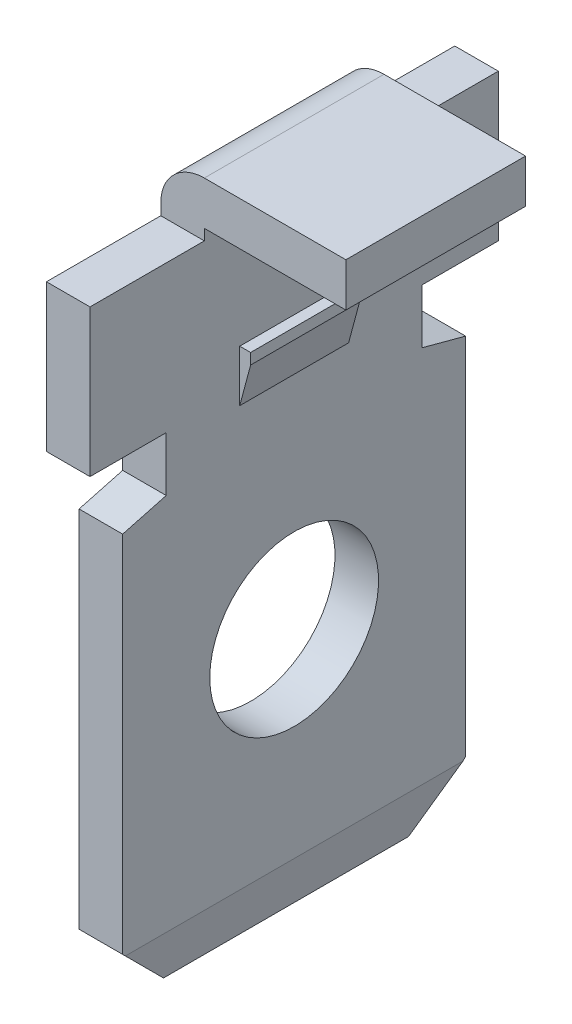
ISO-10303-21;
HEADER;
FILE_DESCRIPTION(('STEP AP214'),'2;1');
FILE_NAME('part.step','',(''),(''),'','','');
FILE_SCHEMA(('AUTOMOTIVE_DESIGN { 1 0 10303 214 1 1 1 1 }'));
ENDSEC;
DATA;
#1=APPLICATION_CONTEXT('core data for automotive mechanical design processes');
#2=APPLICATION_PROTOCOL_DEFINITION('international standard','automotive_design',2000,#1);
#3=PRODUCT_CONTEXT('',#1,'mechanical');
#4=PRODUCT('Part','Part','',(#3));
#5=PRODUCT_RELATED_PRODUCT_CATEGORY('part','',(#4));
#6=PRODUCT_DEFINITION_FORMATION('','',#4);
#7=PRODUCT_DEFINITION_CONTEXT('part definition',#1,'design');
#8=PRODUCT_DEFINITION('design','',#6,#7);
#9=PRODUCT_DEFINITION_SHAPE('','',#8);
#10=(LENGTH_UNIT() NAMED_UNIT(*) SI_UNIT(.MILLI.,.METRE.));
#11=(NAMED_UNIT(*) PLANE_ANGLE_UNIT() SI_UNIT($,.RADIAN.));
#12=(NAMED_UNIT(*) SI_UNIT($,.STERADIAN.) SOLID_ANGLE_UNIT());
#13=UNCERTAINTY_MEASURE_WITH_UNIT(LENGTH_MEASURE(1.E-05),#10,'distance_accuracy_value','');
#14=(GEOMETRIC_REPRESENTATION_CONTEXT(3) GLOBAL_UNCERTAINTY_ASSIGNED_CONTEXT((#13)) GLOBAL_UNIT_ASSIGNED_CONTEXT((#10,
#11,#12)) REPRESENTATION_CONTEXT('',''));
#15=CARTESIAN_POINT('',(0.,0.,0.));
#16=DIRECTION('',(0.,0.,1.));
#17=DIRECTION('',(1.,0.,0.));
#18=AXIS2_PLACEMENT_3D('',#15,#16,#17);
#19=CARTESIAN_POINT('',(0.2,-2.4,-1.));
#20=DIRECTION('',(1.,0.,0.));
#21=DIRECTION('',(0.,0.,-1.));
#22=AXIS2_PLACEMENT_3D('',#19,#20,#21);
#23=PLANE('',#22);
#24=DIRECTION('',(0.,0.,1.));
#25=VECTOR('',#24,1.);
#26=CARTESIAN_POINT('',(0.200000000000035,-2.40000000000001,-1.));
#27=LINE('',#26,#25);
#28=CARTESIAN_POINT('',(0.200000000000009,-2.4,-1.));
#29=VERTEX_POINT('',#28);
#30=CARTESIAN_POINT('',(0.200000000000018,-2.4,1.));
#31=VERTEX_POINT('',#30);
#32=EDGE_CURVE('E288',#29,#31,#27,.T.);
#33=ORIENTED_EDGE('',*,*,#32,.F.);
#34=DIRECTION('',(0.,1.,0.));
#35=VECTOR('',#34,1.);
#36=CARTESIAN_POINT('',(0.2,-2.4,-1.));
#37=LINE('',#36,#35);
#38=CARTESIAN_POINT('',(0.2,-2.2,-1.));
#39=VERTEX_POINT('',#38);
#40=EDGE_CURVE('E264',#29,#39,#37,.T.);
#41=ORIENTED_EDGE('',*,*,#40,.T.);
#42=DIRECTION('',(0.,0.,1.));
#43=VECTOR('',#42,1.);
#44=CARTESIAN_POINT('',(0.2,-2.2,-1.));
#45=LINE('',#44,#43);
#46=CARTESIAN_POINT('',(0.2,-2.2,1.));
#47=VERTEX_POINT('',#46);
#48=EDGE_CURVE('E412',#47,#39,#45,.F.);
#49=ORIENTED_EDGE('',*,*,#48,.F.);
#50=DIRECTION('',(0.,1.,0.));
#51=VECTOR('',#50,1.);
#52=CARTESIAN_POINT('',(0.2,0.,1.));
#53=LINE('',#52,#51);
#54=EDGE_CURVE('E418',#31,#47,#53,.T.);
#55=ORIENTED_EDGE('',*,*,#54,.F.);
#56=EDGE_LOOP('',(#33,#41,#49,#55));
#57=FACE_BOUND('',#56,.T.);
#58=ADVANCED_FACE('F16',(#57),#23,.T.);
#59=CARTESIAN_POINT('',(-0.8,0.8,1.65));
#60=DIRECTION('',(0.,0.,-1.));
#61=DIRECTION('',(-1.,0.,0.));
#62=AXIS2_PLACEMENT_3D('',#59,#60,#61);
#63=PLANE('',#62);
#64=DIRECTION('',(1.,0.,0.));
#65=VECTOR('',#64,1.);
#66=CARTESIAN_POINT('',(2.6,0.8,1.65));
#67=LINE('',#66,#65);
#68=CARTESIAN_POINT('',(0.,0.8,1.65));
#69=VERTEX_POINT('',#68);
#70=CARTESIAN_POINT('',(2.6,0.8,1.65));
#71=VERTEX_POINT('',#70);
#72=EDGE_CURVE('E242',#69,#71,#67,.T.);
#73=ORIENTED_EDGE('',*,*,#72,.F.);
#74=CARTESIAN_POINT('',(0.,0.,1.65));
#75=DIRECTION('',(0.,0.,-1.));
#76=DIRECTION('',(-1.,0.,0.));
#77=AXIS2_PLACEMENT_3D('',#74,#75,#76);
#78=CIRCLE('',#77,0.8);
#79=CARTESIAN_POINT('',(-0.8,0.,1.65));
#80=VERTEX_POINT('',#79);
#81=EDGE_CURVE('E19',#80,#69,#78,.T.);
#82=ORIENTED_EDGE('',*,*,#81,.F.);
#83=DIRECTION('',(0.,1.,0.));
#84=VECTOR('',#83,1.);
#85=CARTESIAN_POINT('',(-0.8,0.8,1.65));
#86=LINE('',#85,#84);
#87=CARTESIAN_POINT('',(-0.8,-0.2,1.65));
#88=VERTEX_POINT('',#87);
#89=EDGE_CURVE('E218',#88,#80,#86,.T.);
#90=ORIENTED_EDGE('',*,*,#89,.F.);
#91=DIRECTION('',(-1.,0.,0.));
#92=VECTOR('',#91,1.);
#93=CARTESIAN_POINT('',(-0.8,-0.2,1.65));
#94=LINE('',#93,#92);
#95=CARTESIAN_POINT('',(0.,-0.2,1.65));
#96=VERTEX_POINT('',#95);
#97=EDGE_CURVE('E230',#96,#88,#94,.T.);
#98=ORIENTED_EDGE('',*,*,#97,.F.);
#99=DIRECTION('',(0.,1.,0.));
#100=VECTOR('',#99,1.);
#101=CARTESIAN_POINT('',(0.,0.8,1.65));
#102=LINE('',#101,#100);
#103=CARTESIAN_POINT('',(0.,0.,1.65));
#104=VERTEX_POINT('',#103);
#105=EDGE_CURVE('E265',#104,#96,#102,.F.);
#106=ORIENTED_EDGE('',*,*,#105,.F.);
#107=DIRECTION('',(1.,0.,0.));
#108=VECTOR('',#107,1.);
#109=CARTESIAN_POINT('',(0.,0.,1.65));
#110=LINE('',#109,#108);
#111=CARTESIAN_POINT('',(2.6,0.,1.65));
#112=VERTEX_POINT('',#111);
#113=EDGE_CURVE('E281',#112,#104,#110,.F.);
#114=ORIENTED_EDGE('',*,*,#113,.F.);
#115=DIRECTION('',(0.,1.,0.));
#116=VECTOR('',#115,1.);
#117=CARTESIAN_POINT('',(2.6,0.,1.65));
#118=LINE('',#117,#116);
#119=EDGE_CURVE('E244',#71,#112,#118,.F.);
#120=ORIENTED_EDGE('',*,*,#119,.F.);
#121=EDGE_LOOP('',(#73,#82,#90,#98,#106,#114,#120));
#122=FACE_BOUND('',#121,.T.);
#123=ADVANCED_FACE('F240',(#122),#63,.F.);
#124=CARTESIAN_POINT('',(2.6,0.,-3.75));
#125=DIRECTION('',(1.,0.,0.));
#126=DIRECTION('',(0.,0.,-1.));
#127=AXIS2_PLACEMENT_3D('',#124,#125,#126);
#128=PLANE('',#127);
#129=DIRECTION('',(0.,0.,-1.));
#130=VECTOR('',#129,1.);
#131=CARTESIAN_POINT('',(2.6,0.,-3.75));
#132=LINE('',#131,#130);
#133=CARTESIAN_POINT('',(2.6,0.,-1.65));
#134=VERTEX_POINT('',#133);
#135=EDGE_CURVE('E278',#134,#112,#132,.F.);
#136=ORIENTED_EDGE('',*,*,#135,.F.);
#137=DIRECTION('',(0.,1.,0.));
#138=VECTOR('',#137,1.);
#139=CARTESIAN_POINT('',(2.6,-0.2,-1.65));
#140=LINE('',#139,#138);
#141=CARTESIAN_POINT('',(2.6,0.8,-1.65));
#142=VERTEX_POINT('',#141);
#143=EDGE_CURVE('E245',#134,#142,#140,.T.);
#144=ORIENTED_EDGE('',*,*,#143,.T.);
#145=DIRECTION('',(0.,0.,1.));
#146=VECTOR('',#145,1.);
#147=CARTESIAN_POINT('',(2.6,0.8,-3.75));
#148=LINE('',#147,#146);
#149=EDGE_CURVE('E258',#71,#142,#148,.F.);
#150=ORIENTED_EDGE('',*,*,#149,.F.);
#151=ORIENTED_EDGE('',*,*,#119,.T.);
#152=EDGE_LOOP('',(#136,#144,#150,#151));
#153=FACE_BOUND('',#152,.T.);
#154=ADVANCED_FACE('F348',(#153),#128,.T.);
#155=CARTESIAN_POINT('',(-0.8,-0.2,-1.65));
#156=DIRECTION('',(0.,0.,1.));
#157=DIRECTION('',(1.,0.,0.));
#158=AXIS2_PLACEMENT_3D('',#155,#156,#157);
#159=PLANE('',#158);
#160=DIRECTION('',(1.,0.,0.));
#161=VECTOR('',#160,1.);
#162=CARTESIAN_POINT('',(-0.8,-0.2,-1.65));
#163=LINE('',#162,#161);
#164=CARTESIAN_POINT('',(-0.8,-0.2,-1.65));
#165=VERTEX_POINT('',#164);
#166=CARTESIAN_POINT('',(0.,-0.2,-1.65));
#167=VERTEX_POINT('',#166);
#168=EDGE_CURVE('E272',#165,#167,#163,.T.);
#169=ORIENTED_EDGE('',*,*,#168,.F.);
#170=DIRECTION('',(0.,1.,0.));
#171=VECTOR('',#170,1.);
#172=CARTESIAN_POINT('',(-0.8,-0.2,-1.65));
#173=LINE('',#172,#171);
#174=CARTESIAN_POINT('',(-0.8,0.,-1.65));
#175=VERTEX_POINT('',#174);
#176=EDGE_CURVE('E275',#175,#165,#173,.F.);
#177=ORIENTED_EDGE('',*,*,#176,.F.);
#178=CARTESIAN_POINT('',(0.,0.,-1.65));
#179=DIRECTION('',(0.,0.,-1.));
#180=DIRECTION('',(-1.,0.,0.));
#181=AXIS2_PLACEMENT_3D('',#178,#179,#180);
#182=CIRCLE('',#181,0.8);
#183=CARTESIAN_POINT('',(0.,0.8,-1.65));
#184=VERTEX_POINT('',#183);
#185=EDGE_CURVE('E237',#184,#175,#182,.F.);
#186=ORIENTED_EDGE('',*,*,#185,.F.);
#187=DIRECTION('',(1.,0.,0.));
#188=VECTOR('',#187,1.);
#189=CARTESIAN_POINT('',(2.6,0.8,-1.65));
#190=LINE('',#189,#188);
#191=EDGE_CURVE('E335',#142,#184,#190,.F.);
#192=ORIENTED_EDGE('',*,*,#191,.F.);
#193=ORIENTED_EDGE('',*,*,#143,.F.);
#194=DIRECTION('',(1.,0.,0.));
#195=VECTOR('',#194,1.);
#196=CARTESIAN_POINT('',(0.,0.,-1.65));
#197=LINE('',#196,#195);
#198=CARTESIAN_POINT('',(0.,0.,-1.65));
#199=VERTEX_POINT('',#198);
#200=EDGE_CURVE('E285',#199,#134,#197,.T.);
#201=ORIENTED_EDGE('',*,*,#200,.F.);
#202=DIRECTION('',(0.,1.,0.));
#203=VECTOR('',#202,1.);
#204=CARTESIAN_POINT('',(0.,-0.2,-1.65));
#205=LINE('',#204,#203);
#206=EDGE_CURVE('E274',#167,#199,#205,.T.);
#207=ORIENTED_EDGE('',*,*,#206,.F.);
#208=EDGE_LOOP('',(#169,#177,#186,#192,#193,#201,#207));
#209=FACE_BOUND('',#208,.T.);
#210=ADVANCED_FACE('F353',(#209),#159,.F.);
#211=CARTESIAN_POINT('',(-0.075,-11.27465386353,0.));
#212=DIRECTION('',(0.984807753012213,-0.173648177666902,0.));
#213=DIRECTION('',(0.173648177666902,0.984807753012213,0.));
#214=AXIS2_PLACEMENT_3D('',#211,#212,#213);
#215=PLANE('',#214);
#216=DIRECTION('',(0.,0.,-1.));
#217=VECTOR('',#216,1.);
#218=CARTESIAN_POINT('',(0.,-10.84930772706,-3.75));
#219=LINE('',#218,#217);
#220=CARTESIAN_POINT('',(-1.19570558966206E-13,-10.8493077270596,3.10069227294263));
#221=VERTEX_POINT('',#220);
#222=CARTESIAN_POINT('',(-1.19634561543189E-13,-10.8493077270596,-3.10069227294262));
#223=VERTEX_POINT('',#222);
#224=EDGE_CURVE('E316',#221,#223,#219,.T.);
#225=ORIENTED_EDGE('',*,*,#224,.F.);
#226=DIRECTION('',(-0.123724030206255,-0.701673843158681,-0.701673843161086));
#227=VECTOR('',#226,1.);
#228=CARTESIAN_POINT('',(-2.39283419467551E-13,-10.84930772706,3.100692272943));
#229=LINE('',#228,#227);
#230=CARTESIAN_POINT('',(-0.14999999999988,-11.7,2.25));
#231=VERTEX_POINT('',#230);
#232=EDGE_CURVE('E282',#221,#231,#229,.T.);
#233=ORIENTED_EDGE('',*,*,#232,.T.);
#234=DIRECTION('',(0.,0.,-1.));
#235=VECTOR('',#234,1.);
#236=CARTESIAN_POINT('',(-0.15,-11.7,-3.75));
#237=LINE('',#236,#235);
#238=CARTESIAN_POINT('',(-0.14999999999988,-11.7,-2.25));
#239=VERTEX_POINT('',#238);
#240=EDGE_CURVE('E338',#239,#231,#237,.F.);
#241=ORIENTED_EDGE('',*,*,#240,.F.);
#242=DIRECTION('',(0.123724030206255,0.701673843158681,-0.701673843161086));
#243=VECTOR('',#242,1.);
#244=CARTESIAN_POINT('',(-0.149999999999761,-11.7,-2.25));
#245=LINE('',#244,#243);
#246=EDGE_CURVE('E424',#239,#223,#245,.T.);
#247=ORIENTED_EDGE('',*,*,#246,.T.);
#248=EDGE_LOOP('',(#225,#233,#241,#247));
#249=FACE_BOUND('',#248,.T.);
#250=ADVANCED_FACE('F428',(#249),#215,.T.);
#251=CARTESIAN_POINT('',(0.,0.,-3.75));
#252=DIRECTION('',(0.,-1.,0.));
#253=DIRECTION('',(0.,0.,-1.));
#254=AXIS2_PLACEMENT_3D('',#251,#252,#253);
#255=PLANE('',#254);
#256=DIRECTION('',(0.,0.,-1.));
#257=VECTOR('',#256,1.);
#258=CARTESIAN_POINT('',(0.,0.,-3.75));
#259=LINE('',#258,#257);
#260=EDGE_CURVE('E312',#199,#104,#259,.F.);
#261=ORIENTED_EDGE('',*,*,#260,.F.);
#262=ORIENTED_EDGE('',*,*,#200,.T.);
#263=ORIENTED_EDGE('',*,*,#135,.T.);
#264=ORIENTED_EDGE('',*,*,#113,.T.);
#265=EDGE_LOOP('',(#261,#262,#263,#264));
#266=FACE_BOUND('',#265,.T.);
#267=ADVANCED_FACE('F841',(#266),#255,.T.);
#268=CARTESIAN_POINT('',(0.,-3.146410161514,-1.));
#269=DIRECTION('',(0.965925826289076,-0.258819045102493,0.));
#270=DIRECTION('',(0.258819045102493,0.965925826289076,0.));
#271=AXIS2_PLACEMENT_3D('',#268,#269,#270);
#272=PLANE('',#271);
#273=DIRECTION('',(0.258819045102448,0.965925826289088,0.));
#274=VECTOR('',#273,1.);
#275=CARTESIAN_POINT('',(0.,-3.146410161514,1.));
#276=LINE('',#275,#274);
#277=CARTESIAN_POINT('',(0.,-3.146410161514,1.));
#278=VERTEX_POINT('',#277);
#279=EDGE_CURVE('E420',#278,#31,#276,.T.);
#280=ORIENTED_EDGE('',*,*,#279,.F.);
#281=DIRECTION('',(0.,0.,-1.));
#282=VECTOR('',#281,1.);
#283=CARTESIAN_POINT('',(0.,-3.146410161514,-3.75));
#284=LINE('',#283,#282);
#285=CARTESIAN_POINT('',(0.,-3.146410161514,-1.));
#286=VERTEX_POINT('',#285);
#287=EDGE_CURVE('E315',#286,#278,#284,.F.);
#288=ORIENTED_EDGE('',*,*,#287,.F.);
#289=DIRECTION('',(0.258819045102448,0.965925826289088,0.));
#290=VECTOR('',#289,1.);
#291=CARTESIAN_POINT('',(0.,-3.146410161514,-1.));
#292=LINE('',#291,#290);
#293=EDGE_CURVE('E409',#286,#29,#292,.T.);
#294=ORIENTED_EDGE('',*,*,#293,.T.);
#295=ORIENTED_EDGE('',*,*,#32,.T.);
#296=EDGE_LOOP('',(#280,#288,#294,#295));
#297=FACE_BOUND('',#296,.T.);
#298=ADVANCED_FACE('F832',(#297),#272,.T.);
#299=CARTESIAN_POINT('',(0.,0.,1.));
#300=DIRECTION('',(0.,0.,1.));
#301=DIRECTION('',(1.,0.,0.));
#302=AXIS2_PLACEMENT_3D('',#299,#300,#301);
#303=PLANE('',#302);
#304=DIRECTION('',(1.,0.,0.));
#305=VECTOR('',#304,1.);
#306=CARTESIAN_POINT('',(0.2,-2.2,1.));
#307=LINE('',#306,#305);
#308=CARTESIAN_POINT('',(0.,-2.2,1.));
#309=VERTEX_POINT('',#308);
#310=EDGE_CURVE('E415',#309,#47,#307,.T.);
#311=ORIENTED_EDGE('',*,*,#310,.F.);
#312=DIRECTION('',(0.,1.,0.));
#313=VECTOR('',#312,1.);
#314=CARTESIAN_POINT('',(0.,-11.7,1.));
#315=LINE('',#314,#313);
#316=EDGE_CURVE('E397',#278,#309,#315,.T.);
#317=ORIENTED_EDGE('',*,*,#316,.F.);
#318=ORIENTED_EDGE('',*,*,#279,.T.);
#319=ORIENTED_EDGE('',*,*,#54,.T.);
#320=EDGE_LOOP('',(#311,#317,#318,#319));
#321=FACE_BOUND('',#320,.T.);
#322=ADVANCED_FACE('F823',(#321),#303,.T.);
#323=CARTESIAN_POINT('',(0.2,-2.2,-1.));
#324=DIRECTION('',(0.,1.,0.));
#325=DIRECTION('',(0.,0.,1.));
#326=AXIS2_PLACEMENT_3D('',#323,#324,#325);
#327=PLANE('',#326);
#328=DIRECTION('',(1.,0.,0.));
#329=VECTOR('',#328,1.);
#330=CARTESIAN_POINT('',(0.,-2.2,-1.));
#331=LINE('',#330,#329);
#332=CARTESIAN_POINT('',(0.,-2.2,-1.));
#333=VERTEX_POINT('',#332);
#334=EDGE_CURVE('E259',#39,#333,#331,.F.);
#335=ORIENTED_EDGE('',*,*,#334,.T.);
#336=DIRECTION('',(0.,0.,-1.));
#337=VECTOR('',#336,1.);
#338=CARTESIAN_POINT('',(0.,-2.2,-3.75));
#339=LINE('',#338,#337);
#340=EDGE_CURVE('E394',#309,#333,#339,.T.);
#341=ORIENTED_EDGE('',*,*,#340,.F.);
#342=ORIENTED_EDGE('',*,*,#310,.T.);
#343=ORIENTED_EDGE('',*,*,#48,.T.);
#344=EDGE_LOOP('',(#335,#341,#342,#343));
#345=FACE_BOUND('',#344,.T.);
#346=ADVANCED_FACE('F814',(#345),#327,.T.);
#347=CARTESIAN_POINT('',(0.,0.,-1.));
#348=DIRECTION('',(0.,0.,1.));
#349=DIRECTION('',(1.,0.,0.));
#350=AXIS2_PLACEMENT_3D('',#347,#348,#349);
#351=PLANE('',#350);
#352=ORIENTED_EDGE('',*,*,#40,.F.);
#353=ORIENTED_EDGE('',*,*,#293,.F.);
#354=DIRECTION('',(0.,1.,0.));
#355=VECTOR('',#354,1.);
#356=CARTESIAN_POINT('',(0.,-11.7,-1.));
#357=LINE('',#356,#355);
#358=EDGE_CURVE('E391',#333,#286,#357,.F.);
#359=ORIENTED_EDGE('',*,*,#358,.F.);
#360=ORIENTED_EDGE('',*,*,#334,.F.);
#361=EDGE_LOOP('',(#352,#353,#359,#360));
#362=FACE_BOUND('',#361,.T.);
#363=ADVANCED_FACE('F562',(#362),#351,.F.);
#364=CARTESIAN_POINT('',(2.6,0.8,-3.75));
#365=DIRECTION('',(0.,1.,0.));
#366=DIRECTION('',(0.,0.,1.));
#367=AXIS2_PLACEMENT_3D('',#364,#365,#366);
#368=PLANE('',#367);
#369=ORIENTED_EDGE('',*,*,#149,.T.);
#370=ORIENTED_EDGE('',*,*,#191,.T.);
#371=DIRECTION('',(0.,0.,-1.));
#372=VECTOR('',#371,1.);
#373=CARTESIAN_POINT('',(0.,0.8,13.527));
#374=LINE('',#373,#372);
#375=EDGE_CURVE('E305',#69,#184,#374,.T.);
#376=ORIENTED_EDGE('',*,*,#375,.F.);
#377=ORIENTED_EDGE('',*,*,#72,.T.);
#378=EDGE_LOOP('',(#369,#370,#376,#377));
#379=FACE_BOUND('',#378,.T.);
#380=ADVANCED_FACE('F346',(#379),#368,.T.);
#381=CARTESIAN_POINT('',(-0.8,-11.7,-3.75));
#382=DIRECTION('',(0.,-1.,0.));
#383=DIRECTION('',(0.,0.,-1.));
#384=AXIS2_PLACEMENT_3D('',#381,#382,#383);
#385=PLANE('',#384);
#386=ORIENTED_EDGE('',*,*,#240,.T.);
#387=DIRECTION('',(1.,0.,0.));
#388=VECTOR('',#387,1.);
#389=CARTESIAN_POINT('',(-0.8,-11.7,2.25));
#390=LINE('',#389,#388);
#391=CARTESIAN_POINT('',(-0.65000000000006,-11.7,2.25));
#392=VERTEX_POINT('',#391);
#393=EDGE_CURVE('E404',#231,#392,#390,.F.);
#394=ORIENTED_EDGE('',*,*,#393,.T.);
#395=DIRECTION('',(0.,0.,1.));
#396=VECTOR('',#395,1.);
#397=CARTESIAN_POINT('',(-0.650000000000239,-11.7,0.));
#398=LINE('',#397,#396);
#399=CARTESIAN_POINT('',(-0.65000000000006,-11.7,-2.25));
#400=VERTEX_POINT('',#399);
#401=EDGE_CURVE('E444',#400,#392,#398,.T.);
#402=ORIENTED_EDGE('',*,*,#401,.F.);
#403=DIRECTION('',(1.,0.,0.));
#404=VECTOR('',#403,1.);
#405=CARTESIAN_POINT('',(-0.4,-11.7,-2.25));
#406=LINE('',#405,#404);
#407=EDGE_CURVE('E446',#239,#400,#406,.F.);
#408=ORIENTED_EDGE('',*,*,#407,.F.);
#409=EDGE_LOOP('',(#386,#394,#402,#408));
#410=FACE_BOUND('',#409,.T.);
#411=ADVANCED_FACE('F551',(#410),#385,.T.);
#412=CARTESIAN_POINT('',(0.,-11.7,-3.75));
#413=DIRECTION('',(1.,0.,0.));
#414=DIRECTION('',(0.,0.,-1.));
#415=AXIS2_PLACEMENT_3D('',#412,#413,#414);
#416=PLANE('',#415);
#417=ORIENTED_EDGE('',*,*,#340,.T.);
#418=ORIENTED_EDGE('',*,*,#358,.T.);
#419=ORIENTED_EDGE('',*,*,#287,.T.);
#420=ORIENTED_EDGE('',*,*,#316,.T.);
#421=EDGE_LOOP('',(#417,#418,#419,#420));
#422=FACE_BOUND('',#421,.T.);
#423=CARTESIAN_POINT('',(0.,-7.2,0.));
#424=DIRECTION('',(-1.,0.,0.));
#425=DIRECTION('',(0.,0.,1.));
#426=AXIS2_PLACEMENT_3D('',#423,#424,#425);
#427=CIRCLE('',#426,1.55);
#428=CARTESIAN_POINT('',(0.,-7.2,1.55));
#429=VERTEX_POINT('',#428);
#430=EDGE_CURVE('E324',#429,#429,#427,.T.);
#431=ORIENTED_EDGE('',*,*,#430,.T.);
#432=EDGE_LOOP('',(#431));
#433=FACE_BOUND('',#432,.T.);
#434=DIRECTION('',(0.,1.,0.));
#435=VECTOR('',#434,1.);
#436=CARTESIAN_POINT('',(0.,-4.114359353945,3.15));
#437=LINE('',#436,#435);
#438=CARTESIAN_POINT('',(0.,-4.11435935394497,3.15000000000001));
#439=VERTEX_POINT('',#438);
#440=CARTESIAN_POINT('',(0.,-10.8,3.15));
#441=VERTEX_POINT('',#440);
#442=EDGE_CURVE('E387',#439,#441,#437,.F.);
#443=ORIENTED_EDGE('',*,*,#442,.T.);
#444=DIRECTION('',(0.,-0.707106781186548,-0.707106781186548));
#445=VECTOR('',#444,1.);
#446=CARTESIAN_POINT('',(0.,-11.25,2.7));
#447=LINE('',#446,#445);
#448=EDGE_CURVE('E437',#221,#441,#447,.F.);
#449=ORIENTED_EDGE('',*,*,#448,.F.);
#450=ORIENTED_EDGE('',*,*,#224,.T.);
#451=DIRECTION('',(0.,0.707106781186548,-0.707106781186548));
#452=VECTOR('',#451,1.);
#453=CARTESIAN_POINT('',(0.,-11.25,-2.7));
#454=LINE('',#453,#452);
#455=CARTESIAN_POINT('',(0.,-10.8,-3.15));
#456=VERTEX_POINT('',#455);
#457=EDGE_CURVE('E434',#456,#223,#454,.F.);
#458=ORIENTED_EDGE('',*,*,#457,.F.);
#459=DIRECTION('',(0.,1.,0.));
#460=VECTOR('',#459,1.);
#461=CARTESIAN_POINT('',(0.,-11.7,-3.15));
#462=LINE('',#461,#460);
#463=CARTESIAN_POINT('',(0.,-4.114359353945,-3.15));
#464=VERTEX_POINT('',#463);
#465=EDGE_CURVE('E453',#456,#464,#462,.T.);
#466=ORIENTED_EDGE('',*,*,#465,.T.);
#467=DIRECTION('',(0.,-0.258819045102493,-0.965925826289076));
#468=VECTOR('',#467,1.);
#469=CARTESIAN_POINT('',(0.,-4.114359353945,-3.15));
#470=LINE('',#469,#468);
#471=CARTESIAN_POINT('',(0.,-3.90000000000003,-2.34999999999999));
#472=VERTEX_POINT('',#471);
#473=EDGE_CURVE('E457',#464,#472,#470,.F.);
#474=ORIENTED_EDGE('',*,*,#473,.T.);
#475=DIRECTION('',(0.,1.,0.));
#476=VECTOR('',#475,1.);
#477=CARTESIAN_POINT('',(0.,-3.9,-2.35));
#478=LINE('',#477,#476);
#479=CARTESIAN_POINT('',(0.,-2.9,-2.35));
#480=VERTEX_POINT('',#479);
#481=EDGE_CURVE('E461',#472,#480,#478,.T.);
#482=ORIENTED_EDGE('',*,*,#481,.T.);
#483=DIRECTION('',(0.,0.,1.));
#484=VECTOR('',#483,1.);
#485=CARTESIAN_POINT('',(0.,-2.9,-2.35));
#486=LINE('',#485,#484);
#487=CARTESIAN_POINT('',(0.,-2.9,-3.75));
#488=VERTEX_POINT('',#487);
#489=EDGE_CURVE('E463',#480,#488,#486,.F.);
#490=ORIENTED_EDGE('',*,*,#489,.T.);
#491=DIRECTION('',(0.,1.,0.));
#492=VECTOR('',#491,1.);
#493=CARTESIAN_POINT('',(0.,0.,-3.75));
#494=LINE('',#493,#492);
#495=CARTESIAN_POINT('',(0.,-0.2,-3.75));
#496=VERTEX_POINT('',#495);
#497=EDGE_CURVE('E363',#488,#496,#494,.T.);
#498=ORIENTED_EDGE('',*,*,#497,.T.);
#499=DIRECTION('',(0.,0.,-1.));
#500=VECTOR('',#499,1.);
#501=CARTESIAN_POINT('',(0.,-0.2,-3.75));
#502=LINE('',#501,#500);
#503=EDGE_CURVE('E341',#496,#167,#502,.F.);
#504=ORIENTED_EDGE('',*,*,#503,.T.);
#505=ORIENTED_EDGE('',*,*,#206,.T.);
#506=ORIENTED_EDGE('',*,*,#260,.T.);
#507=ORIENTED_EDGE('',*,*,#105,.T.);
#508=DIRECTION('',(0.,0.,-1.));
#509=VECTOR('',#508,1.);
#510=CARTESIAN_POINT('',(0.,-0.2,1.65));
#511=LINE('',#510,#509);
#512=CARTESIAN_POINT('',(0.,-0.2,3.75));
#513=VERTEX_POINT('',#512);
#514=EDGE_CURVE('E302',#96,#513,#511,.F.);
#515=ORIENTED_EDGE('',*,*,#514,.T.);
#516=DIRECTION('',(0.,1.,0.));
#517=VECTOR('',#516,1.);
#518=CARTESIAN_POINT('',(0.,0.,3.75));
#519=LINE('',#518,#517);
#520=CARTESIAN_POINT('',(0.,-2.9,3.75));
#521=VERTEX_POINT('',#520);
#522=EDGE_CURVE('E370',#521,#513,#519,.T.);
#523=ORIENTED_EDGE('',*,*,#522,.F.);
#524=DIRECTION('',(0.,0.,1.));
#525=VECTOR('',#524,1.);
#526=CARTESIAN_POINT('',(0.,-2.9,3.75));
#527=LINE('',#526,#525);
#528=CARTESIAN_POINT('',(0.,-2.9,2.35));
#529=VERTEX_POINT('',#528);
#530=EDGE_CURVE('E377',#521,#529,#527,.F.);
#531=ORIENTED_EDGE('',*,*,#530,.T.);
#532=DIRECTION('',(0.,1.,0.));
#533=VECTOR('',#532,1.);
#534=CARTESIAN_POINT('',(0.,-2.9,2.35));
#535=LINE('',#534,#533);
#536=CARTESIAN_POINT('',(0.,-3.9,2.35));
#537=VERTEX_POINT('',#536);
#538=EDGE_CURVE('E381',#529,#537,#535,.F.);
#539=ORIENTED_EDGE('',*,*,#538,.T.);
#540=DIRECTION('',(0.,0.258819045102493,-0.965925826289076));
#541=VECTOR('',#540,1.);
#542=CARTESIAN_POINT('',(0.,-3.9,2.35));
#543=LINE('',#542,#541);
#544=EDGE_CURVE('E385',#537,#439,#543,.F.);
#545=ORIENTED_EDGE('',*,*,#544,.T.);
#546=EDGE_LOOP('',(#443,#449,#450,#458,#466,#474,#482,#490,#498,#504,#505,#506,#507,#515,#523,
#531,#539,#545));
#547=FACE_BOUND('',#546,.T.);
#548=ADVANCED_FACE('F361',(#422,#433,#547),#416,.T.);
#549=CARTESIAN_POINT('',(-0.6,-2.4,-1.));
#550=DIRECTION('',(1.,0.,0.));
#551=DIRECTION('',(0.,0.,-1.));
#552=AXIS2_PLACEMENT_3D('',#549,#550,#551);
#553=PLANE('',#552);
#554=DIRECTION('',(0.,1.,0.));
#555=VECTOR('',#554,1.);
#556=CARTESIAN_POINT('',(-0.6,0.,1.));
#557=LINE('',#556,#555);
#558=CARTESIAN_POINT('',(-0.599999999999991,-2.4,1.));
#559=VERTEX_POINT('',#558);
#560=CARTESIAN_POINT('',(-0.6,-2.2,1.));
#561=VERTEX_POINT('',#560);
#562=EDGE_CURVE('E502',#559,#561,#557,.T.);
#563=ORIENTED_EDGE('',*,*,#562,.T.);
#564=DIRECTION('',(0.,0.,1.));
#565=VECTOR('',#564,1.);
#566=CARTESIAN_POINT('',(-0.6,-2.2,-1.));
#567=LINE('',#566,#565);
#568=CARTESIAN_POINT('',(-0.6,-2.2,-1.));
#569=VERTEX_POINT('',#568);
#570=EDGE_CURVE('E326',#561,#569,#567,.F.);
#571=ORIENTED_EDGE('',*,*,#570,.T.);
#572=DIRECTION('',(0.,1.,0.));
#573=VECTOR('',#572,1.);
#574=CARTESIAN_POINT('',(-0.6,-2.4,-1.));
#575=LINE('',#574,#573);
#576=CARTESIAN_POINT('',(-0.599999999999991,-2.4,-1.));
#577=VERTEX_POINT('',#576);
#578=EDGE_CURVE('E389',#577,#569,#575,.T.);
#579=ORIENTED_EDGE('',*,*,#578,.F.);
#580=DIRECTION('',(0.,0.,1.));
#581=VECTOR('',#580,1.);
#582=CARTESIAN_POINT('',(-0.599999999999965,-2.40000000000001,-1.));
#583=LINE('',#582,#581);
#584=EDGE_CURVE('E498',#577,#559,#583,.T.);
#585=ORIENTED_EDGE('',*,*,#584,.T.);
#586=EDGE_LOOP('',(#563,#571,#579,#585));
#587=FACE_BOUND('',#586,.T.);
#588=ADVANCED_FACE('F559',(#587),#553,.F.);
#589=CARTESIAN_POINT('',(-0.8,-4.114359353945,3.15));
#590=DIRECTION('',(0.,0.,-1.));
#591=DIRECTION('',(-1.,0.,0.));
#592=AXIS2_PLACEMENT_3D('',#589,#590,#591);
#593=PLANE('',#592);
#594=DIRECTION('',(1.,0.,0.));
#595=VECTOR('',#594,1.);
#596=CARTESIAN_POINT('',(-0.8,-4.11435935394488,3.15000000000003));
#597=LINE('',#596,#595);
#598=CARTESIAN_POINT('',(-0.8,-4.11435935394497,3.15000000000001));
#599=VERTEX_POINT('',#598);
#600=EDGE_CURVE('E383',#439,#599,#597,.F.);
#601=ORIENTED_EDGE('',*,*,#600,.T.);
#602=DIRECTION('',(0.,1.,0.));
#603=VECTOR('',#602,1.);
#604=CARTESIAN_POINT('',(-0.8,0.8,3.15));
#605=LINE('',#604,#603);
#606=CARTESIAN_POINT('',(-0.8,-10.8,3.15));
#607=VERTEX_POINT('',#606);
#608=EDGE_CURVE('E489',#607,#599,#605,.T.);
#609=ORIENTED_EDGE('',*,*,#608,.F.);
#610=DIRECTION('',(1.,0.,0.));
#611=VECTOR('',#610,1.);
#612=CARTESIAN_POINT('',(-0.4,-10.8,3.15));
#613=LINE('',#612,#611);
#614=EDGE_CURVE('E508',#441,#607,#613,.F.);
#615=ORIENTED_EDGE('',*,*,#614,.F.);
#616=ORIENTED_EDGE('',*,*,#442,.F.);
#617=EDGE_LOOP('',(#601,#609,#615,#616));
#618=FACE_BOUND('',#617,.T.);
#619=ADVANCED_FACE('F632',(#618),#593,.F.);
#620=CARTESIAN_POINT('',(-0.8,-3.9,2.35));
#621=DIRECTION('',(0.,-0.965925826289076,-0.258819045102493));
#622=DIRECTION('',(0.,0.258819045102493,-0.965925826289076));
#623=AXIS2_PLACEMENT_3D('',#620,#621,#622);
#624=PLANE('',#623);
#625=ORIENTED_EDGE('',*,*,#544,.F.);
#626=DIRECTION('',(-1.,0.,0.));
#627=VECTOR('',#626,1.);
#628=CARTESIAN_POINT('',(-0.8,-3.9,2.35));
#629=LINE('',#628,#627);
#630=CARTESIAN_POINT('',(-0.8,-3.9,2.35));
#631=VERTEX_POINT('',#630);
#632=EDGE_CURVE('E379',#537,#631,#629,.T.);
#633=ORIENTED_EDGE('',*,*,#632,.T.);
#634=DIRECTION('',(0.,0.258819045102635,-0.965925826289038));
#635=VECTOR('',#634,1.);
#636=CARTESIAN_POINT('',(-0.8,-4.114359353945,3.15));
#637=LINE('',#636,#635);
#638=EDGE_CURVE('E486',#599,#631,#637,.T.);
#639=ORIENTED_EDGE('',*,*,#638,.F.);
#640=ORIENTED_EDGE('',*,*,#600,.F.);
#641=EDGE_LOOP('',(#625,#633,#639,#640));
#642=FACE_BOUND('',#641,.T.);
#643=ADVANCED_FACE('F628',(#642),#624,.F.);
#644=CARTESIAN_POINT('',(-0.8,-2.9,2.35));
#645=DIRECTION('',(0.,0.,-1.));
#646=DIRECTION('',(-1.,0.,0.));
#647=AXIS2_PLACEMENT_3D('',#644,#645,#646);
#648=PLANE('',#647);
#649=ORIENTED_EDGE('',*,*,#538,.F.);
#650=DIRECTION('',(1.,0.,0.));
#651=VECTOR('',#650,1.);
#652=CARTESIAN_POINT('',(-0.8,-2.9,2.35));
#653=LINE('',#652,#651);
#654=CARTESIAN_POINT('',(-0.8,-2.9,2.35));
#655=VERTEX_POINT('',#654);
#656=EDGE_CURVE('E375',#529,#655,#653,.F.);
#657=ORIENTED_EDGE('',*,*,#656,.T.);
#658=DIRECTION('',(0.,1.,0.));
#659=VECTOR('',#658,1.);
#660=CARTESIAN_POINT('',(-0.8,0.8,2.35));
#661=LINE('',#660,#659);
#662=EDGE_CURVE('E483',#631,#655,#661,.T.);
#663=ORIENTED_EDGE('',*,*,#662,.F.);
#664=ORIENTED_EDGE('',*,*,#632,.F.);
#665=EDGE_LOOP('',(#649,#657,#663,#664));
#666=FACE_BOUND('',#665,.T.);
#667=ADVANCED_FACE('F624',(#666),#648,.F.);
#668=CARTESIAN_POINT('',(-0.8,-2.9,3.75));
#669=DIRECTION('',(0.,1.,0.));
#670=DIRECTION('',(0.,0.,1.));
#671=AXIS2_PLACEMENT_3D('',#668,#669,#670);
#672=PLANE('',#671);
#673=ORIENTED_EDGE('',*,*,#656,.F.);
#674=ORIENTED_EDGE('',*,*,#530,.F.);
#675=DIRECTION('',(1.,0.,0.));
#676=VECTOR('',#675,1.);
#677=CARTESIAN_POINT('',(0.,-2.9,3.75));
#678=LINE('',#677,#676);
#679=CARTESIAN_POINT('',(-0.8,-2.9,3.75));
#680=VERTEX_POINT('',#679);
#681=EDGE_CURVE('E372',#680,#521,#678,.T.);
#682=ORIENTED_EDGE('',*,*,#681,.F.);
#683=DIRECTION('',(0.,0.,1.));
#684=VECTOR('',#683,1.);
#685=CARTESIAN_POINT('',(-0.8,-2.9,-3.75));
#686=LINE('',#685,#684);
#687=EDGE_CURVE('E480',#655,#680,#686,.T.);
#688=ORIENTED_EDGE('',*,*,#687,.F.);
#689=EDGE_LOOP('',(#673,#674,#682,#688));
#690=FACE_BOUND('',#689,.T.);
#691=ADVANCED_FACE('F620',(#690),#672,.F.);
#692=CARTESIAN_POINT('',(0.,0.,3.75));
#693=DIRECTION('',(0.,0.,1.));
#694=DIRECTION('',(1.,0.,0.));
#695=AXIS2_PLACEMENT_3D('',#692,#693,#694);
#696=PLANE('',#695);
#697=ORIENTED_EDGE('',*,*,#522,.T.);
#698=DIRECTION('',(1.,0.,0.));
#699=VECTOR('',#698,1.);
#700=CARTESIAN_POINT('',(-0.8,-0.2,3.75));
#701=LINE('',#700,#699);
#702=CARTESIAN_POINT('',(-0.8,-0.2,3.75));
#703=VERTEX_POINT('',#702);
#704=EDGE_CURVE('E306',#513,#703,#701,.F.);
#705=ORIENTED_EDGE('',*,*,#704,.T.);
#706=DIRECTION('',(0.,1.,0.));
#707=VECTOR('',#706,1.);
#708=CARTESIAN_POINT('',(-0.8,0.8,3.75));
#709=LINE('',#708,#707);
#710=EDGE_CURVE('E296',#680,#703,#709,.T.);
#711=ORIENTED_EDGE('',*,*,#710,.F.);
#712=ORIENTED_EDGE('',*,*,#681,.T.);
#713=EDGE_LOOP('',(#697,#705,#711,#712));
#714=FACE_BOUND('',#713,.T.);
#715=ADVANCED_FACE('F616',(#714),#696,.T.);
#716=CARTESIAN_POINT('',(-0.8,-0.2,1.65));
#717=DIRECTION('',(0.,-1.,0.));
#718=DIRECTION('',(0.,0.,-1.));
#719=AXIS2_PLACEMENT_3D('',#716,#717,#718);
#720=PLANE('',#719);
#721=ORIENTED_EDGE('',*,*,#97,.T.);
#722=DIRECTION('',(0.,0.,1.));
#723=VECTOR('',#722,1.);
#724=CARTESIAN_POINT('',(-0.8,-0.2,-3.75));
#725=LINE('',#724,#723);
#726=EDGE_CURVE('E226',#703,#88,#725,.F.);
#727=ORIENTED_EDGE('',*,*,#726,.F.);
#728=ORIENTED_EDGE('',*,*,#704,.F.);
#729=ORIENTED_EDGE('',*,*,#514,.F.);
#730=EDGE_LOOP('',(#721,#727,#728,#729));
#731=FACE_BOUND('',#730,.T.);
#732=ADVANCED_FACE('F613',(#731),#720,.F.);
#733=CARTESIAN_POINT('',(0.,0.,13.527));
#734=DIRECTION('',(0.,0.,-1.));
#735=DIRECTION('',(-1.,0.,0.));
#736=AXIS2_PLACEMENT_3D('',#733,#734,#735);
#737=CYLINDRICAL_SURFACE('',#736,0.8);
#738=ORIENTED_EDGE('',*,*,#375,.T.);
#739=ORIENTED_EDGE('',*,*,#185,.T.);
#740=DIRECTION('',(0.,0.,1.));
#741=VECTOR('',#740,1.);
#742=CARTESIAN_POINT('',(-0.8,0.,-3.75));
#743=LINE('',#742,#741);
#744=EDGE_CURVE('E222',#80,#175,#743,.F.);
#745=ORIENTED_EDGE('',*,*,#744,.F.);
#746=ORIENTED_EDGE('',*,*,#81,.T.);
#747=EDGE_LOOP('',(#738,#739,#745,#746));
#748=FACE_BOUND('',#747,.T.);
#749=ADVANCED_FACE('F235',(#748),#737,.T.);
#750=CARTESIAN_POINT('',(-0.8,-0.2,-3.75));
#751=DIRECTION('',(0.,-1.,0.));
#752=DIRECTION('',(0.,0.,-1.));
#753=AXIS2_PLACEMENT_3D('',#750,#751,#752);
#754=PLANE('',#753);
#755=ORIENTED_EDGE('',*,*,#168,.T.);
#756=ORIENTED_EDGE('',*,*,#503,.F.);
#757=DIRECTION('',(1.,0.,0.));
#758=VECTOR('',#757,1.);
#759=CARTESIAN_POINT('',(0.,-0.2,-3.75));
#760=LINE('',#759,#758);
#761=CARTESIAN_POINT('',(-0.8,-0.2,-3.75));
#762=VERTEX_POINT('',#761);
#763=EDGE_CURVE('E365',#496,#762,#760,.F.);
#764=ORIENTED_EDGE('',*,*,#763,.T.);
#765=DIRECTION('',(0.,0.,1.));
#766=VECTOR('',#765,1.);
#767=CARTESIAN_POINT('',(-0.8,-0.2,-3.75));
#768=LINE('',#767,#766);
#769=EDGE_CURVE('E238',#165,#762,#768,.F.);
#770=ORIENTED_EDGE('',*,*,#769,.F.);
#771=EDGE_LOOP('',(#755,#756,#764,#770));
#772=FACE_BOUND('',#771,.T.);
#773=ADVANCED_FACE('F358',(#772),#754,.F.);
#774=CARTESIAN_POINT('',(0.,0.,-3.75));
#775=DIRECTION('',(0.,0.,1.));
#776=DIRECTION('',(1.,0.,0.));
#777=AXIS2_PLACEMENT_3D('',#774,#775,#776);
#778=PLANE('',#777);
#779=ORIENTED_EDGE('',*,*,#763,.F.);
#780=ORIENTED_EDGE('',*,*,#497,.F.);
#781=DIRECTION('',(1.,0.,0.));
#782=VECTOR('',#781,1.);
#783=CARTESIAN_POINT('',(-0.8,-2.9,-3.75));
#784=LINE('',#783,#782);
#785=CARTESIAN_POINT('',(-0.8,-2.9,-3.75));
#786=VERTEX_POINT('',#785);
#787=EDGE_CURVE('E465',#488,#786,#784,.F.);
#788=ORIENTED_EDGE('',*,*,#787,.T.);
#789=DIRECTION('',(0.,1.,0.));
#790=VECTOR('',#789,1.);
#791=CARTESIAN_POINT('',(-0.8,0.8,-3.75));
#792=LINE('',#791,#790);
#793=EDGE_CURVE('E269',#762,#786,#792,.F.);
#794=ORIENTED_EDGE('',*,*,#793,.F.);
#795=EDGE_LOOP('',(#779,#780,#788,#794));
#796=FACE_BOUND('',#795,.T.);
#797=ADVANCED_FACE('F469',(#796),#778,.F.);
#798=CARTESIAN_POINT('',(-0.8,-2.9,-2.35));
#799=DIRECTION('',(0.,1.,0.));
#800=DIRECTION('',(0.,0.,1.));
#801=AXIS2_PLACEMENT_3D('',#798,#799,#800);
#802=PLANE('',#801);
#803=DIRECTION('',(1.,0.,0.));
#804=VECTOR('',#803,1.);
#805=CARTESIAN_POINT('',(-0.8,-2.9,-2.35));
#806=LINE('',#805,#804);
#807=CARTESIAN_POINT('',(-0.8,-2.9,-2.35));
#808=VERTEX_POINT('',#807);
#809=EDGE_CURVE('E459',#480,#808,#806,.F.);
#810=ORIENTED_EDGE('',*,*,#809,.T.);
#811=DIRECTION('',(0.,0.,1.));
#812=VECTOR('',#811,1.);
#813=CARTESIAN_POINT('',(-0.8,-2.9,-3.75));
#814=LINE('',#813,#812);
#815=EDGE_CURVE('E473',#786,#808,#814,.T.);
#816=ORIENTED_EDGE('',*,*,#815,.F.);
#817=ORIENTED_EDGE('',*,*,#787,.F.);
#818=ORIENTED_EDGE('',*,*,#489,.F.);
#819=EDGE_LOOP('',(#810,#816,#817,#818));
#820=FACE_BOUND('',#819,.T.);
#821=ADVANCED_FACE('F603',(#820),#802,.F.);
#822=CARTESIAN_POINT('',(-0.8,-3.9,-2.35));
#823=DIRECTION('',(0.,0.,1.));
#824=DIRECTION('',(1.,0.,0.));
#825=AXIS2_PLACEMENT_3D('',#822,#823,#824);
#826=PLANE('',#825);
#827=ORIENTED_EDGE('',*,*,#481,.F.);
#828=DIRECTION('',(1.,0.,0.));
#829=VECTOR('',#828,1.);
#830=CARTESIAN_POINT('',(-0.8,-3.90000000000012,-2.34999999999997));
#831=LINE('',#830,#829);
#832=CARTESIAN_POINT('',(-0.8,-3.90000000000003,-2.34999999999999));
#833=VERTEX_POINT('',#832);
#834=EDGE_CURVE('E455',#472,#833,#831,.F.);
#835=ORIENTED_EDGE('',*,*,#834,.T.);
#836=DIRECTION('',(0.,1.,0.));
#837=VECTOR('',#836,1.);
#838=CARTESIAN_POINT('',(-0.8,0.8,-2.35));
#839=LINE('',#838,#837);
#840=EDGE_CURVE('E475',#808,#833,#839,.F.);
#841=ORIENTED_EDGE('',*,*,#840,.F.);
#842=ORIENTED_EDGE('',*,*,#809,.F.);
#843=EDGE_LOOP('',(#827,#835,#841,#842));
#844=FACE_BOUND('',#843,.T.);
#845=ADVANCED_FACE('F542',(#844),#826,.F.);
#846=CARTESIAN_POINT('',(-0.8,-4.114359353945,-3.15));
#847=DIRECTION('',(0.,-0.965925826289076,0.258819045102493));
#848=DIRECTION('',(0.,-0.258819045102493,-0.965925826289076));
#849=AXIS2_PLACEMENT_3D('',#846,#847,#848);
#850=PLANE('',#849);
#851=ORIENTED_EDGE('',*,*,#473,.F.);
#852=DIRECTION('',(1.,0.,0.));
#853=VECTOR('',#852,1.);
#854=CARTESIAN_POINT('',(-0.8,-4.114359353945,-3.15));
#855=LINE('',#854,#853);
#856=CARTESIAN_POINT('',(-0.8,-4.114359353945,-3.15));
#857=VERTEX_POINT('',#856);
#858=EDGE_CURVE('E451',#464,#857,#855,.F.);
#859=ORIENTED_EDGE('',*,*,#858,.T.);
#860=DIRECTION('',(0.,-0.258819045102635,-0.965925826289038));
#861=VECTOR('',#860,1.);
#862=CARTESIAN_POINT('',(-0.8,-3.9,-2.35));
#863=LINE('',#862,#861);
#864=EDGE_CURVE('E534',#833,#857,#863,.T.);
#865=ORIENTED_EDGE('',*,*,#864,.F.);
#866=ORIENTED_EDGE('',*,*,#834,.F.);
#867=EDGE_LOOP('',(#851,#859,#865,#866));
#868=FACE_BOUND('',#867,.T.);
#869=ADVANCED_FACE('F546',(#868),#850,.F.);
#870=CARTESIAN_POINT('',(-0.8,-11.7,-3.15));
#871=DIRECTION('',(0.,0.,1.));
#872=DIRECTION('',(1.,0.,0.));
#873=AXIS2_PLACEMENT_3D('',#870,#871,#872);
#874=PLANE('',#873);
#875=ORIENTED_EDGE('',*,*,#858,.F.);
#876=ORIENTED_EDGE('',*,*,#465,.F.);
#877=DIRECTION('',(1.,0.,0.));
#878=VECTOR('',#877,1.);
#879=CARTESIAN_POINT('',(-0.4,-10.8,-3.15));
#880=LINE('',#879,#878);
#881=CARTESIAN_POINT('',(-0.8,-10.8,-3.15));
#882=VERTEX_POINT('',#881);
#883=EDGE_CURVE('E440',#882,#456,#880,.T.);
#884=ORIENTED_EDGE('',*,*,#883,.F.);
#885=DIRECTION('',(0.,1.,0.));
#886=VECTOR('',#885,1.);
#887=CARTESIAN_POINT('',(-0.8,0.8,-3.15));
#888=LINE('',#887,#886);
#889=EDGE_CURVE('E529',#857,#882,#888,.F.);
#890=ORIENTED_EDGE('',*,*,#889,.F.);
#891=EDGE_LOOP('',(#875,#876,#884,#890));
#892=FACE_BOUND('',#891,.T.);
#893=ADVANCED_FACE('F550',(#892),#874,.F.);
#894=CARTESIAN_POINT('',(-0.4,-11.25,-2.7));
#895=DIRECTION('',(0.,-0.707106781186548,-0.707106781186548));
#896=DIRECTION('',(0.,0.707106781186548,-0.707106781186548));
#897=AXIS2_PLACEMENT_3D('',#894,#895,#896);
#898=PLANE('',#897);
#899=ORIENTED_EDGE('',*,*,#457,.T.);
#900=ORIENTED_EDGE('',*,*,#246,.F.);
#901=ORIENTED_EDGE('',*,*,#407,.T.);
#902=DIRECTION('',(0.123724030206255,-0.701673843158681,0.701673843161086));
#903=VECTOR('',#902,1.);
#904=CARTESIAN_POINT('',(-0.799999999999761,-10.84930772706,-3.100692272943));
#905=LINE('',#904,#903);
#906=CARTESIAN_POINT('',(-0.79999999999994,-10.8493077270592,-3.10069227294225));
#907=VERTEX_POINT('',#906);
#908=EDGE_CURVE('E441',#907,#400,#905,.T.);
#909=ORIENTED_EDGE('',*,*,#908,.F.);
#910=DIRECTION('',(0.,-0.707106781208054,0.707106781165041));
#911=VECTOR('',#910,1.);
#912=CARTESIAN_POINT('',(-0.8,-10.8,-3.15));
#913=LINE('',#912,#911);
#914=EDGE_CURVE('E527',#882,#907,#913,.T.);
#915=ORIENTED_EDGE('',*,*,#914,.F.);
#916=ORIENTED_EDGE('',*,*,#883,.T.);
#917=EDGE_LOOP('',(#899,#900,#901,#909,#915,#916));
#918=FACE_BOUND('',#917,.T.);
#919=ADVANCED_FACE('F438',(#918),#898,.T.);
#920=CARTESIAN_POINT('',(-0.725,-11.27465386353,0.));
#921=DIRECTION('',(-0.984807753012213,-0.173648177666902,0.));
#922=DIRECTION('',(0.173648177666902,-0.984807753012213,0.));
#923=AXIS2_PLACEMENT_3D('',#920,#921,#922);
#924=PLANE('',#923);
#925=ORIENTED_EDGE('',*,*,#401,.T.);
#926=DIRECTION('',(0.123724030206649,-0.701673843159849,-0.701673843159849));
#927=VECTOR('',#926,1.);
#928=CARTESIAN_POINT('',(-0.8,-10.8493077270585,3.1006922729415));
#929=LINE('',#928,#927);
#930=CARTESIAN_POINT('',(-0.79999999999988,-10.8493077270596,3.10069227294262));
#931=VERTEX_POINT('',#930);
#932=EDGE_CURVE('E327',#931,#392,#929,.T.);
#933=ORIENTED_EDGE('',*,*,#932,.F.);
#934=DIRECTION('',(0.,0.,1.));
#935=VECTOR('',#934,1.);
#936=CARTESIAN_POINT('',(-0.8,-10.84930772706,-3.75));
#937=LINE('',#936,#935);
#938=EDGE_CURVE('E523',#907,#931,#937,.T.);
#939=ORIENTED_EDGE('',*,*,#938,.F.);
#940=ORIENTED_EDGE('',*,*,#908,.T.);
#941=EDGE_LOOP('',(#925,#933,#939,#940));
#942=FACE_BOUND('',#941,.T.);
#943=ADVANCED_FACE('F514',(#942),#924,.T.);
#944=CARTESIAN_POINT('',(-0.4,-11.25,2.7));
#945=DIRECTION('',(0.,-0.707106781186548,0.707106781186548));
#946=DIRECTION('',(0.,-0.707106781186548,-0.707106781186548));
#947=AXIS2_PLACEMENT_3D('',#944,#945,#946);
#948=PLANE('',#947);
#949=DIRECTION('',(0.,0.707106781208054,0.707106781165041));
#950=VECTOR('',#949,1.);
#951=CARTESIAN_POINT('',(-0.8,-10.84930772706,3.100692272943));
#952=LINE('',#951,#950);
#953=EDGE_CURVE('E323',#931,#607,#952,.T.);
#954=ORIENTED_EDGE('',*,*,#953,.F.);
#955=ORIENTED_EDGE('',*,*,#932,.T.);
#956=ORIENTED_EDGE('',*,*,#393,.F.);
#957=ORIENTED_EDGE('',*,*,#232,.F.);
#958=ORIENTED_EDGE('',*,*,#448,.T.);
#959=ORIENTED_EDGE('',*,*,#614,.T.);
#960=EDGE_LOOP('',(#954,#955,#956,#957,#958,#959));
#961=FACE_BOUND('',#960,.T.);
#962=ADVANCED_FACE('F520',(#961),#948,.T.);
#963=CARTESIAN_POINT('',(-0.8,-7.2,0.));
#964=DIRECTION('',(-1.,0.,0.));
#965=DIRECTION('',(0.,0.,1.));
#966=AXIS2_PLACEMENT_3D('',#963,#964,#965);
#967=CYLINDRICAL_SURFACE('',#966,1.55);
#968=CARTESIAN_POINT('',(-0.8,-7.2,0.));
#969=DIRECTION('',(-1.,0.,0.));
#970=DIRECTION('',(0.,0.,1.));
#971=AXIS2_PLACEMENT_3D('',#968,#969,#970);
#972=CIRCLE('',#971,1.55);
#973=CARTESIAN_POINT('',(-0.8,-7.2,1.55));
#974=VERTEX_POINT('',#973);
#975=EDGE_CURVE('E319',#974,#974,#972,.F.);
#976=ORIENTED_EDGE('',*,*,#975,.F.);
#977=EDGE_LOOP('',(#976));
#978=FACE_BOUND('',#977,.T.);
#979=ORIENTED_EDGE('',*,*,#430,.F.);
#980=EDGE_LOOP('',(#979));
#981=FACE_BOUND('',#980,.T.);
#982=ADVANCED_FACE('F586',(#978,#981),#967,.F.);
#983=CARTESIAN_POINT('',(-0.6,-2.2,-1.));
#984=DIRECTION('',(0.,1.,0.));
#985=DIRECTION('',(0.,0.,1.));
#986=AXIS2_PLACEMENT_3D('',#983,#984,#985);
#987=PLANE('',#986);
#988=ORIENTED_EDGE('',*,*,#570,.F.);
#989=DIRECTION('',(1.,0.,0.));
#990=VECTOR('',#989,1.);
#991=CARTESIAN_POINT('',(0.,-2.2,1.));
#992=LINE('',#991,#990);
#993=CARTESIAN_POINT('',(-0.8,-2.2,1.));
#994=VERTEX_POINT('',#993);
#995=EDGE_CURVE('E500',#561,#994,#992,.F.);
#996=ORIENTED_EDGE('',*,*,#995,.T.);
#997=DIRECTION('',(0.,0.,1.));
#998=VECTOR('',#997,1.);
#999=CARTESIAN_POINT('',(-0.8,-2.2,-3.75));
#1000=LINE('',#999,#998);
#1001=CARTESIAN_POINT('',(-0.8,-2.2,-1.));
#1002=VERTEX_POINT('',#1001);
#1003=EDGE_CURVE('E322',#1002,#994,#1000,.T.);
#1004=ORIENTED_EDGE('',*,*,#1003,.F.);
#1005=DIRECTION('',(1.,0.,0.));
#1006=VECTOR('',#1005,1.);
#1007=CARTESIAN_POINT('',(0.,-2.2,-1.));
#1008=LINE('',#1007,#1006);
#1009=EDGE_CURVE('E492',#569,#1002,#1008,.F.);
#1010=ORIENTED_EDGE('',*,*,#1009,.F.);
#1011=EDGE_LOOP('',(#988,#996,#1004,#1010));
#1012=FACE_BOUND('',#1011,.T.);
#1013=ADVANCED_FACE('F582',(#1012),#987,.F.);
#1014=CARTESIAN_POINT('',(0.,0.,1.));
#1015=DIRECTION('',(0.,0.,1.));
#1016=DIRECTION('',(1.,0.,0.));
#1017=AXIS2_PLACEMENT_3D('',#1014,#1015,#1016);
#1018=PLANE('',#1017);
#1019=ORIENTED_EDGE('',*,*,#562,.F.);
#1020=DIRECTION('',(0.258819045102493,0.965925826289076,0.));
#1021=VECTOR('',#1020,1.);
#1022=CARTESIAN_POINT('',(-0.8,-3.146410161514,1.));
#1023=LINE('',#1022,#1021);
#1024=CARTESIAN_POINT('',(-0.8,-3.146410161514,1.));
#1025=VERTEX_POINT('',#1024);
#1026=EDGE_CURVE('E496',#559,#1025,#1023,.F.);
#1027=ORIENTED_EDGE('',*,*,#1026,.T.);
#1028=DIRECTION('',(0.,1.,0.));
#1029=VECTOR('',#1028,1.);
#1030=CARTESIAN_POINT('',(-0.8,0.8,1.));
#1031=LINE('',#1030,#1029);
#1032=EDGE_CURVE('E648',#994,#1025,#1031,.F.);
#1033=ORIENTED_EDGE('',*,*,#1032,.F.);
#1034=ORIENTED_EDGE('',*,*,#995,.F.);
#1035=EDGE_LOOP('',(#1019,#1027,#1033,#1034));
#1036=FACE_BOUND('',#1035,.T.);
#1037=ADVANCED_FACE('F579',(#1036),#1018,.F.);
#1038=CARTESIAN_POINT('',(-0.8,-3.146410161514,-1.));
#1039=DIRECTION('',(0.965925826289076,-0.258819045102493,0.));
#1040=DIRECTION('',(0.258819045102493,0.965925826289076,0.));
#1041=AXIS2_PLACEMENT_3D('',#1038,#1039,#1040);
#1042=PLANE('',#1041);
#1043=ORIENTED_EDGE('',*,*,#584,.F.);
#1044=DIRECTION('',(0.258819045102448,0.965925826289088,0.));
#1045=VECTOR('',#1044,1.);
#1046=CARTESIAN_POINT('',(-0.8,-3.146410161514,-1.));
#1047=LINE('',#1046,#1045);
#1048=CARTESIAN_POINT('',(-0.8,-3.146410161514,-1.));
#1049=VERTEX_POINT('',#1048);
#1050=EDGE_CURVE('E34',#1049,#577,#1047,.T.);
#1051=ORIENTED_EDGE('',*,*,#1050,.F.);
#1052=DIRECTION('',(0.,0.,1.));
#1053=VECTOR('',#1052,1.);
#1054=CARTESIAN_POINT('',(-0.8,-3.146410161514,-3.75));
#1055=LINE('',#1054,#1053);
#1056=EDGE_CURVE('E25',#1025,#1049,#1055,.F.);
#1057=ORIENTED_EDGE('',*,*,#1056,.F.);
#1058=ORIENTED_EDGE('',*,*,#1026,.F.);
#1059=EDGE_LOOP('',(#1043,#1051,#1057,#1058));
#1060=FACE_BOUND('',#1059,.T.);
#1061=ADVANCED_FACE('F571',(#1060),#1042,.F.);
#1062=CARTESIAN_POINT('',(0.,0.,-1.));
#1063=DIRECTION('',(0.,0.,1.));
#1064=DIRECTION('',(1.,0.,0.));
#1065=AXIS2_PLACEMENT_3D('',#1062,#1063,#1064);
#1066=PLANE('',#1065);
#1067=ORIENTED_EDGE('',*,*,#1009,.T.);
#1068=DIRECTION('',(0.,1.,0.));
#1069=VECTOR('',#1068,1.);
#1070=CARTESIAN_POINT('',(-0.8,0.8,-1.));
#1071=LINE('',#1070,#1069);
#1072=EDGE_CURVE('E11',#1049,#1002,#1071,.T.);
#1073=ORIENTED_EDGE('',*,*,#1072,.F.);
#1074=ORIENTED_EDGE('',*,*,#1050,.T.);
#1075=ORIENTED_EDGE('',*,*,#578,.T.);
#1076=EDGE_LOOP('',(#1067,#1073,#1074,#1075));
#1077=FACE_BOUND('',#1076,.T.);
#1078=ADVANCED_FACE('F565',(#1077),#1066,.T.);
#1079=CARTESIAN_POINT('',(-0.8,0.8,-3.75));
#1080=DIRECTION('',(-1.,0.,0.));
#1081=DIRECTION('',(0.,0.,1.));
#1082=AXIS2_PLACEMENT_3D('',#1079,#1080,#1081);
#1083=PLANE('',#1082);
#1084=ORIENTED_EDGE('',*,*,#1056,.T.);
#1085=ORIENTED_EDGE('',*,*,#1072,.T.);
#1086=ORIENTED_EDGE('',*,*,#1003,.T.);
#1087=ORIENTED_EDGE('',*,*,#1032,.T.);
#1088=EDGE_LOOP('',(#1084,#1085,#1086,#1087));
#1089=FACE_BOUND('',#1088,.T.);
#1090=ORIENTED_EDGE('',*,*,#975,.T.);
#1091=EDGE_LOOP('',(#1090));
#1092=FACE_BOUND('',#1091,.T.);
#1093=ORIENTED_EDGE('',*,*,#938,.T.);
#1094=ORIENTED_EDGE('',*,*,#953,.T.);
#1095=ORIENTED_EDGE('',*,*,#608,.T.);
#1096=ORIENTED_EDGE('',*,*,#638,.T.);
#1097=ORIENTED_EDGE('',*,*,#662,.T.);
#1098=ORIENTED_EDGE('',*,*,#687,.T.);
#1099=ORIENTED_EDGE('',*,*,#710,.T.);
#1100=ORIENTED_EDGE('',*,*,#726,.T.);
#1101=ORIENTED_EDGE('',*,*,#89,.T.);
#1102=ORIENTED_EDGE('',*,*,#744,.T.);
#1103=ORIENTED_EDGE('',*,*,#176,.T.);
#1104=ORIENTED_EDGE('',*,*,#769,.T.);
#1105=ORIENTED_EDGE('',*,*,#793,.T.);
#1106=ORIENTED_EDGE('',*,*,#815,.T.);
#1107=ORIENTED_EDGE('',*,*,#840,.T.);
#1108=ORIENTED_EDGE('',*,*,#864,.T.);
#1109=ORIENTED_EDGE('',*,*,#889,.T.);
#1110=ORIENTED_EDGE('',*,*,#914,.T.);
#1111=EDGE_LOOP('',(#1093,#1094,#1095,#1096,#1097,#1098,#1099,#1100,#1101,#1102,#1103,#1104,
#1105,#1106,#1107,#1108,#1109,#1110));
#1112=FACE_BOUND('',#1111,.T.);
#1113=ADVANCED_FACE('F221',(#1089,#1092,#1112),#1083,.T.);
#1114=CLOSED_SHELL('',(#58,#123,#154,#210,#250,#267,#298,#322,#346,#363,#380,#411,#548,#588,
#619,#643,#667,#691,#715,#732,#749,#773,#797,#821,#845,#869,#893,#919,#943,#962,#982,#1013,
#1037,#1061,#1078,#1113));
#1115=MANIFOLD_SOLID_BREP('B1',#1114);
#1116=ADVANCED_BREP_SHAPE_REPRESENTATION('',(#18,#1115),#14);
#1117=SHAPE_DEFINITION_REPRESENTATION(#9,#1116);
ENDSEC;
END-ISO-10303-21;
